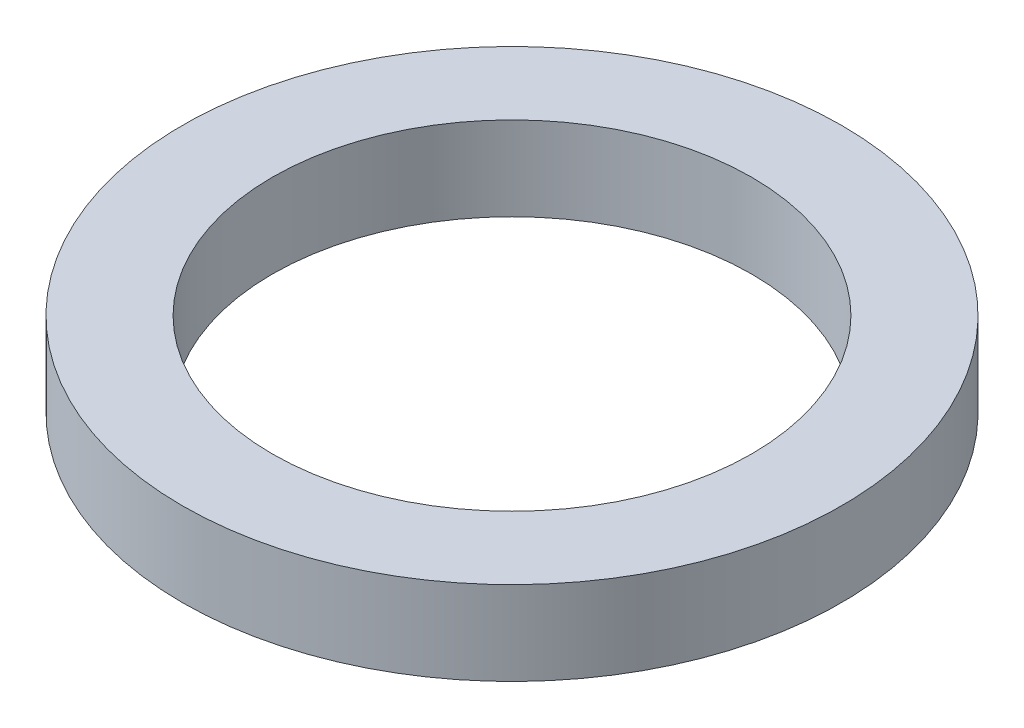
ISO-10303-21;
HEADER;
FILE_DESCRIPTION(('STEP AP214'),'2;1');
FILE_NAME('part.step','',(''),(''),'','','');
FILE_SCHEMA(('AUTOMOTIVE_DESIGN { 1 0 10303 214 1 1 1 1 }'));
ENDSEC;
DATA;
#1=APPLICATION_CONTEXT('core data for automotive mechanical design processes');
#2=APPLICATION_PROTOCOL_DEFINITION('international standard','automotive_design',2000,#1);
#3=PRODUCT_CONTEXT('',#1,'mechanical');
#4=PRODUCT('Part','Part','',(#3));
#5=PRODUCT_RELATED_PRODUCT_CATEGORY('part','',(#4));
#6=PRODUCT_DEFINITION_FORMATION('','',#4);
#7=PRODUCT_DEFINITION_CONTEXT('part definition',#1,'design');
#8=PRODUCT_DEFINITION('design','',#6,#7);
#9=PRODUCT_DEFINITION_SHAPE('','',#8);
#10=(LENGTH_UNIT() NAMED_UNIT(*) SI_UNIT(.MILLI.,.METRE.));
#11=(NAMED_UNIT(*) PLANE_ANGLE_UNIT() SI_UNIT($,.RADIAN.));
#12=(NAMED_UNIT(*) SI_UNIT($,.STERADIAN.) SOLID_ANGLE_UNIT());
#13=UNCERTAINTY_MEASURE_WITH_UNIT(LENGTH_MEASURE(1.E-05),#10,'distance_accuracy_value','');
#14=(GEOMETRIC_REPRESENTATION_CONTEXT(3) GLOBAL_UNCERTAINTY_ASSIGNED_CONTEXT((#13)) GLOBAL_UNIT_ASSIGNED_CONTEXT((#10,
#11,#12)) REPRESENTATION_CONTEXT('',''));
#15=CARTESIAN_POINT('',(0.,0.,0.));
#16=DIRECTION('',(0.,0.,1.));
#17=DIRECTION('',(1.,0.,0.));
#18=AXIS2_PLACEMENT_3D('',#15,#16,#17);
#19=CARTESIAN_POINT('',(0.,14.,0.));
#20=DIRECTION('',(0.,-1.,0.));
#21=DIRECTION('',(0.,0.,-1.));
#22=AXIS2_PLACEMENT_3D('',#19,#20,#21);
#23=CYLINDRICAL_SURFACE('',#22,55.);
#24=CARTESIAN_POINT('',(0.,14.,0.));
#25=DIRECTION('',(0.,1.,0.));
#26=DIRECTION('',(0.,0.,1.));
#27=AXIS2_PLACEMENT_3D('',#24,#25,#26);
#28=CIRCLE('',#27,55.);
#29=CARTESIAN_POINT('',(0.,14.,55.));
#30=VERTEX_POINT('',#29);
#31=EDGE_CURVE('E10',#30,#30,#28,.T.);
#32=ORIENTED_EDGE('',*,*,#31,.F.);
#33=EDGE_LOOP('',(#32));
#34=FACE_BOUND('',#33,.T.);
#35=CARTESIAN_POINT('',(0.,0.,0.));
#36=DIRECTION('',(0.,1.,0.));
#37=DIRECTION('',(0.,0.,1.));
#38=AXIS2_PLACEMENT_3D('',#35,#36,#37);
#39=CIRCLE('',#38,55.);
#40=CARTESIAN_POINT('',(0.,0.,55.));
#41=VERTEX_POINT('',#40);
#42=EDGE_CURVE('E37',#41,#41,#39,.T.);
#43=ORIENTED_EDGE('',*,*,#42,.T.);
#44=EDGE_LOOP('',(#43));
#45=FACE_BOUND('',#44,.T.);
#46=ADVANCED_FACE('F40',(#34,#45),#23,.T.);
#47=CARTESIAN_POINT('',(0.,14.,0.));
#48=DIRECTION('',(0.,1.,0.));
#49=DIRECTION('',(0.,0.,1.));
#50=AXIS2_PLACEMENT_3D('',#47,#48,#49);
#51=PLANE('',#50);
#52=CARTESIAN_POINT('',(0.,14.,0.));
#53=DIRECTION('',(0.,1.,0.));
#54=DIRECTION('',(0.,0.,1.));
#55=AXIS2_PLACEMENT_3D('',#52,#53,#54);
#56=CIRCLE('',#55,40.);
#57=CARTESIAN_POINT('',(0.,14.,40.));
#58=VERTEX_POINT('',#57);
#59=EDGE_CURVE('E50',#58,#58,#56,.T.);
#60=ORIENTED_EDGE('',*,*,#59,.F.);
#61=EDGE_LOOP('',(#60));
#62=FACE_BOUND('',#61,.T.);
#63=ORIENTED_EDGE('',*,*,#31,.T.);
#64=EDGE_LOOP('',(#63));
#65=FACE_BOUND('',#64,.T.);
#66=ADVANCED_FACE('F59',(#62,#65),#51,.T.);
#67=CARTESIAN_POINT('',(0.,0.,0.));
#68=DIRECTION('',(0.,1.,0.));
#69=DIRECTION('',(0.,0.,1.));
#70=AXIS2_PLACEMENT_3D('',#67,#68,#69);
#71=PLANE('',#70);
#72=CARTESIAN_POINT('',(0.,0.,0.));
#73=DIRECTION('',(0.,1.,0.));
#74=DIRECTION('',(0.,0.,1.));
#75=AXIS2_PLACEMENT_3D('',#72,#73,#74);
#76=CIRCLE('',#75,40.);
#77=CARTESIAN_POINT('',(0.,0.,40.));
#78=VERTEX_POINT('',#77);
#79=EDGE_CURVE('E47',#78,#78,#76,.T.);
#80=ORIENTED_EDGE('',*,*,#79,.T.);
#81=EDGE_LOOP('',(#80));
#82=FACE_BOUND('',#81,.T.);
#83=ORIENTED_EDGE('',*,*,#42,.F.);
#84=EDGE_LOOP('',(#83));
#85=FACE_BOUND('',#84,.T.);
#86=ADVANCED_FACE('F58',(#82,#85),#71,.F.);
#87=CARTESIAN_POINT('',(0.,14.,0.));
#88=DIRECTION('',(0.,-1.,0.));
#89=DIRECTION('',(0.,0.,-1.));
#90=AXIS2_PLACEMENT_3D('',#87,#88,#89);
#91=CYLINDRICAL_SURFACE('',#90,40.);
#92=ORIENTED_EDGE('',*,*,#59,.T.);
#93=EDGE_LOOP('',(#92));
#94=FACE_BOUND('',#93,.T.);
#95=ORIENTED_EDGE('',*,*,#79,.F.);
#96=EDGE_LOOP('',(#95));
#97=FACE_BOUND('',#96,.T.);
#98=ADVANCED_FACE('F54',(#94,#97),#91,.F.);
#99=CLOSED_SHELL('',(#46,#66,#86,#98));
#100=MANIFOLD_SOLID_BREP('B2',#99);
#101=ADVANCED_BREP_SHAPE_REPRESENTATION('',(#18,#100),#14);
#102=SHAPE_DEFINITION_REPRESENTATION(#9,#101);
ENDSEC;
END-ISO-10303-21;
